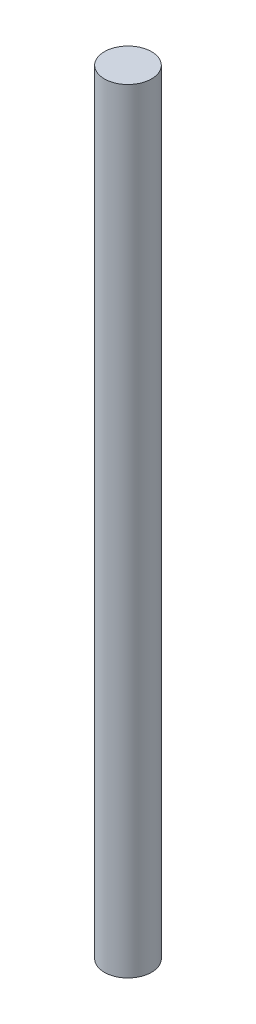
ISO-10303-21;
HEADER;
FILE_DESCRIPTION(('STEP AP214'),'2;1');
FILE_NAME('part.step','',(''),(''),'','','');
FILE_SCHEMA(('AUTOMOTIVE_DESIGN { 1 0 10303 214 1 1 1 1 }'));
ENDSEC;
DATA;
#1=APPLICATION_CONTEXT('core data for automotive mechanical design processes');
#2=APPLICATION_PROTOCOL_DEFINITION('international standard','automotive_design',2000,#1);
#3=PRODUCT_CONTEXT('',#1,'mechanical');
#4=PRODUCT('Part','Part','',(#3));
#5=PRODUCT_RELATED_PRODUCT_CATEGORY('part','',(#4));
#6=PRODUCT_DEFINITION_FORMATION('','',#4);
#7=PRODUCT_DEFINITION_CONTEXT('part definition',#1,'design');
#8=PRODUCT_DEFINITION('design','',#6,#7);
#9=PRODUCT_DEFINITION_SHAPE('','',#8);
#10=(LENGTH_UNIT() NAMED_UNIT(*) SI_UNIT(.MILLI.,.METRE.));
#11=(NAMED_UNIT(*) PLANE_ANGLE_UNIT() SI_UNIT($,.RADIAN.));
#12=(NAMED_UNIT(*) SI_UNIT($,.STERADIAN.) SOLID_ANGLE_UNIT());
#13=UNCERTAINTY_MEASURE_WITH_UNIT(LENGTH_MEASURE(1.E-05),#10,'distance_accuracy_value','');
#14=(GEOMETRIC_REPRESENTATION_CONTEXT(3) GLOBAL_UNCERTAINTY_ASSIGNED_CONTEXT((#13)) GLOBAL_UNIT_ASSIGNED_CONTEXT((#10,
#11,#12)) REPRESENTATION_CONTEXT('',''));
#15=CARTESIAN_POINT('',(0.,0.,0.));
#16=DIRECTION('',(0.,0.,1.));
#17=DIRECTION('',(1.,0.,0.));
#18=AXIS2_PLACEMENT_3D('',#15,#16,#17);
#19=CARTESIAN_POINT('',(0.,52.07,0.));
#20=DIRECTION('',(0.,-1.,0.));
#21=DIRECTION('',(0.,0.,-1.));
#22=AXIS2_PLACEMENT_3D('',#19,#20,#21);
#23=CYLINDRICAL_SURFACE('',#22,1.5875);
#24=CARTESIAN_POINT('',(0.,52.07,0.));
#25=DIRECTION('',(0.,1.,0.));
#26=DIRECTION('',(0.,0.,1.));
#27=AXIS2_PLACEMENT_3D('',#24,#25,#26);
#28=CIRCLE('',#27,1.5875);
#29=CARTESIAN_POINT('',(0.,52.07,1.5875));
#30=VERTEX_POINT('',#29);
#31=EDGE_CURVE('E10',#30,#30,#28,.T.);
#32=ORIENTED_EDGE('',*,*,#31,.F.);
#33=EDGE_LOOP('',(#32));
#34=FACE_BOUND('',#33,.T.);
#35=CARTESIAN_POINT('',(0.,0.,0.));
#36=DIRECTION('',(0.,1.,0.));
#37=DIRECTION('',(0.,0.,1.));
#38=AXIS2_PLACEMENT_3D('',#35,#36,#37);
#39=CIRCLE('',#38,1.5875);
#40=CARTESIAN_POINT('',(0.,0.,1.5875));
#41=VERTEX_POINT('',#40);
#42=EDGE_CURVE('E42',#41,#41,#39,.T.);
#43=ORIENTED_EDGE('',*,*,#42,.T.);
#44=EDGE_LOOP('',(#43));
#45=FACE_BOUND('',#44,.T.);
#46=ADVANCED_FACE('F39',(#34,#45),#23,.T.);
#47=CARTESIAN_POINT('',(0.,52.07,0.));
#48=DIRECTION('',(0.,1.,0.));
#49=DIRECTION('',(0.,0.,1.));
#50=AXIS2_PLACEMENT_3D('',#47,#48,#49);
#51=PLANE('',#50);
#52=ORIENTED_EDGE('',*,*,#31,.T.);
#53=EDGE_LOOP('',(#52));
#54=FACE_BOUND('',#53,.T.);
#55=ADVANCED_FACE('F54',(#54),#51,.T.);
#56=CARTESIAN_POINT('',(0.,0.,0.));
#57=DIRECTION('',(0.,1.,0.));
#58=DIRECTION('',(0.,0.,1.));
#59=AXIS2_PLACEMENT_3D('',#56,#57,#58);
#60=PLANE('',#59);
#61=ORIENTED_EDGE('',*,*,#42,.F.);
#62=EDGE_LOOP('',(#61));
#63=FACE_BOUND('',#62,.T.);
#64=ADVANCED_FACE('F52',(#63),#60,.F.);
#65=CLOSED_SHELL('',(#46,#55,#64));
#66=MANIFOLD_SOLID_BREP('B2',#65);
#67=ADVANCED_BREP_SHAPE_REPRESENTATION('',(#18,#66),#14);
#68=SHAPE_DEFINITION_REPRESENTATION(#9,#67);
ENDSEC;
END-ISO-10303-21;
